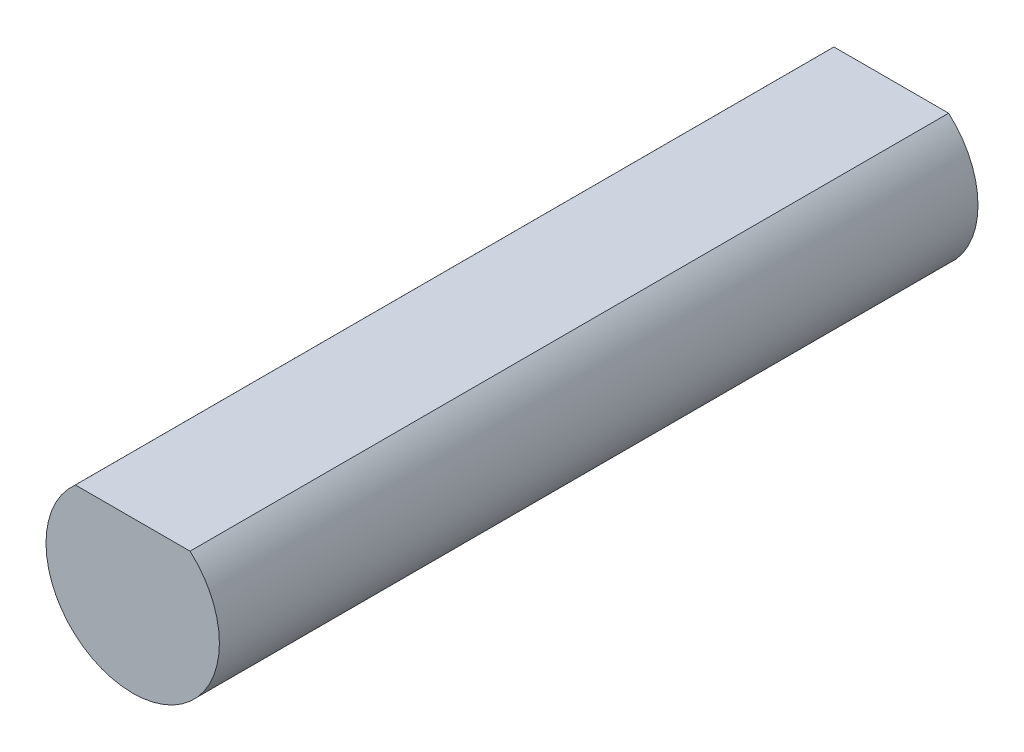
ISO-10303-21;
HEADER;
FILE_DESCRIPTION(('STEP AP214'),'2;1');
FILE_NAME('part.step','',(''),(''),'','','');
FILE_SCHEMA(('AUTOMOTIVE_DESIGN { 1 0 10303 214 1 1 1 1 }'));
ENDSEC;
DATA;
#1=APPLICATION_CONTEXT('core data for automotive mechanical design processes');
#2=APPLICATION_PROTOCOL_DEFINITION('international standard','automotive_design',2000,#1);
#3=PRODUCT_CONTEXT('',#1,'mechanical');
#4=PRODUCT('Part','Part','',(#3));
#5=PRODUCT_RELATED_PRODUCT_CATEGORY('part','',(#4));
#6=PRODUCT_DEFINITION_FORMATION('','',#4);
#7=PRODUCT_DEFINITION_CONTEXT('part definition',#1,'design');
#8=PRODUCT_DEFINITION('design','',#6,#7);
#9=PRODUCT_DEFINITION_SHAPE('','',#8);
#10=(LENGTH_UNIT() NAMED_UNIT(*) SI_UNIT(.MILLI.,.METRE.));
#11=(NAMED_UNIT(*) PLANE_ANGLE_UNIT() SI_UNIT($,.RADIAN.));
#12=(NAMED_UNIT(*) SI_UNIT($,.STERADIAN.) SOLID_ANGLE_UNIT());
#13=UNCERTAINTY_MEASURE_WITH_UNIT(LENGTH_MEASURE(1.E-05),#10,'distance_accuracy_value','');
#14=(GEOMETRIC_REPRESENTATION_CONTEXT(3) GLOBAL_UNCERTAINTY_ASSIGNED_CONTEXT((#13)) GLOBAL_UNIT_ASSIGNED_CONTEXT((#10,
#11,#12)) REPRESENTATION_CONTEXT('',''));
#15=CARTESIAN_POINT('',(0.,0.,0.));
#16=DIRECTION('',(0.,0.,1.));
#17=DIRECTION('',(1.,0.,0.));
#18=AXIS2_PLACEMENT_3D('',#15,#16,#17);
#19=CARTESIAN_POINT('',(0.,0.,35.));
#20=DIRECTION('',(0.,0.,-1.));
#21=DIRECTION('',(-1.,0.,0.));
#22=AXIS2_PLACEMENT_3D('',#19,#20,#21);
#23=CYLINDRICAL_SURFACE('',#22,4.);
#24=CARTESIAN_POINT('',(0.,0.,35.));
#25=DIRECTION('',(0.,0.,1.));
#26=DIRECTION('',(1.,0.,0.));
#27=AXIS2_PLACEMENT_3D('',#24,#25,#26);
#28=CIRCLE('',#27,4.);
#29=CARTESIAN_POINT('',(-2.64575131106459,3.,35.));
#30=VERTEX_POINT('',#29);
#31=CARTESIAN_POINT('',(2.64575131106459,3.,35.));
#32=VERTEX_POINT('',#31);
#33=EDGE_CURVE('E11',#30,#32,#28,.T.);
#34=ORIENTED_EDGE('',*,*,#33,.F.);
#35=DIRECTION('',(0.,0.,1.));
#36=VECTOR('',#35,1.);
#37=CARTESIAN_POINT('',(-2.64575131106459,3.,-0.001000000000001));
#38=LINE('',#37,#36);
#39=CARTESIAN_POINT('',(-2.64575131106459,3.,0.));
#40=VERTEX_POINT('',#39);
#41=EDGE_CURVE('E66',#40,#30,#38,.T.);
#42=ORIENTED_EDGE('',*,*,#41,.F.);
#43=CARTESIAN_POINT('',(0.,0.,0.));
#44=DIRECTION('',(0.,0.,1.));
#45=DIRECTION('',(1.,0.,0.));
#46=AXIS2_PLACEMENT_3D('',#43,#44,#45);
#47=CIRCLE('',#46,4.);
#48=CARTESIAN_POINT('',(2.64575131106459,3.,0.));
#49=VERTEX_POINT('',#48);
#50=EDGE_CURVE('E48',#40,#49,#47,.T.);
#51=ORIENTED_EDGE('',*,*,#50,.T.);
#52=DIRECTION('',(0.,0.,1.));
#53=VECTOR('',#52,1.);
#54=CARTESIAN_POINT('',(2.64575131106459,3.,-0.001000000000001));
#55=LINE('',#54,#53);
#56=EDGE_CURVE('E57',#49,#32,#55,.T.);
#57=ORIENTED_EDGE('',*,*,#56,.T.);
#58=EDGE_LOOP('',(#34,#42,#51,#57));
#59=FACE_BOUND('',#58,.T.);
#60=ADVANCED_FACE('F39',(#59),#23,.T.);
#61=CARTESIAN_POINT('',(0.,0.,35.));
#62=DIRECTION('',(0.,0.,1.));
#63=DIRECTION('',(1.,0.,0.));
#64=AXIS2_PLACEMENT_3D('',#61,#62,#63);
#65=PLANE('',#64);
#66=DIRECTION('',(1.,0.,0.));
#67=VECTOR('',#66,1.);
#68=CARTESIAN_POINT('',(-2.64575131106459,3.,35.));
#69=LINE('',#68,#67);
#70=EDGE_CURVE('E42',#30,#32,#69,.T.);
#71=ORIENTED_EDGE('',*,*,#70,.F.);
#72=ORIENTED_EDGE('',*,*,#33,.T.);
#73=EDGE_LOOP('',(#71,#72));
#74=FACE_BOUND('',#73,.T.);
#75=ADVANCED_FACE('F73',(#74),#65,.T.);
#76=CARTESIAN_POINT('',(0.,0.,0.));
#77=DIRECTION('',(0.,0.,1.));
#78=DIRECTION('',(1.,0.,0.));
#79=AXIS2_PLACEMENT_3D('',#76,#77,#78);
#80=PLANE('',#79);
#81=ORIENTED_EDGE('',*,*,#50,.F.);
#82=DIRECTION('',(-1.,0.,0.));
#83=VECTOR('',#82,1.);
#84=CARTESIAN_POINT('',(-2.64575131106459,3.,0.));
#85=LINE('',#84,#83);
#86=EDGE_CURVE('E62',#49,#40,#85,.T.);
#87=ORIENTED_EDGE('',*,*,#86,.F.);
#88=EDGE_LOOP('',(#81,#87));
#89=FACE_BOUND('',#88,.T.);
#90=ADVANCED_FACE('F75',(#89),#80,.F.);
#91=CARTESIAN_POINT('',(-2.64575131106459,3.,-0.001000000000001));
#92=DIRECTION('',(0.,-1.,0.));
#93=DIRECTION('',(0.,0.,-1.));
#94=AXIS2_PLACEMENT_3D('',#91,#92,#93);
#95=PLANE('',#94);
#96=ORIENTED_EDGE('',*,*,#70,.T.);
#97=ORIENTED_EDGE('',*,*,#56,.F.);
#98=ORIENTED_EDGE('',*,*,#86,.T.);
#99=ORIENTED_EDGE('',*,*,#41,.T.);
#100=EDGE_LOOP('',(#96,#97,#98,#99));
#101=FACE_BOUND('',#100,.T.);
#102=ADVANCED_FACE('F65',(#101),#95,.F.);
#103=CLOSED_SHELL('',(#60,#75,#90,#102));
#104=MANIFOLD_SOLID_BREP('B2',#103);
#105=ADVANCED_BREP_SHAPE_REPRESENTATION('',(#18,#104),#14);
#106=SHAPE_DEFINITION_REPRESENTATION(#9,#105);
ENDSEC;
END-ISO-10303-21;
